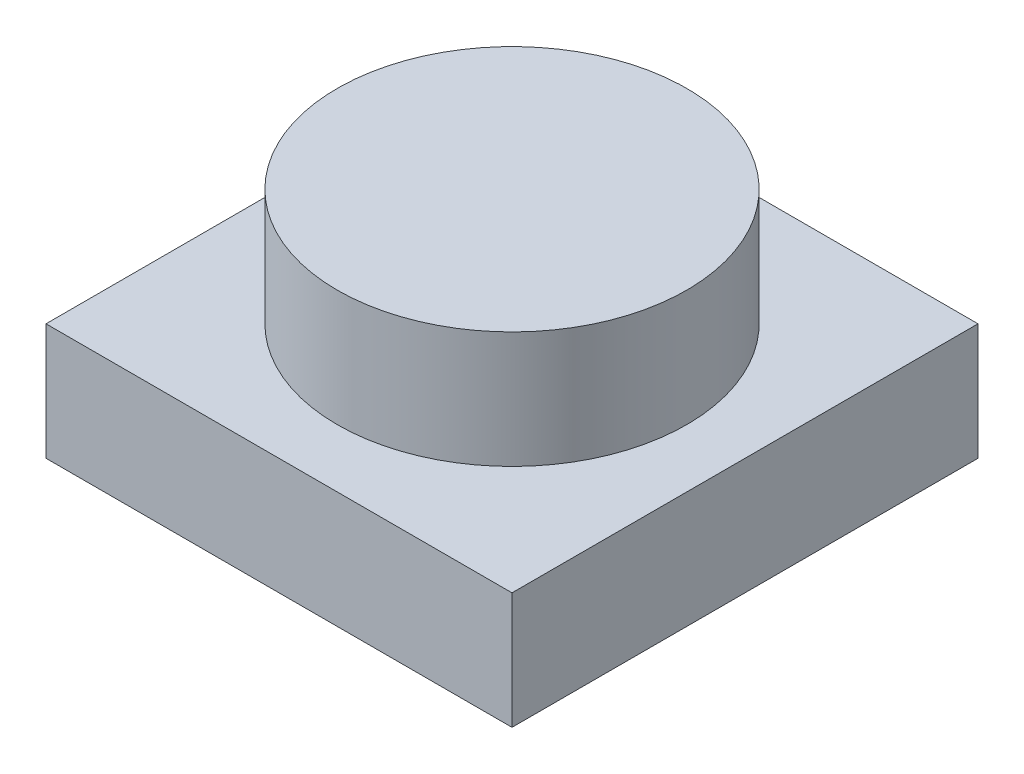
ISO-10303-21;
HEADER;
FILE_DESCRIPTION(('STEP AP214'),'2;1');
FILE_NAME('part.step','',(''),(''),'','','');
FILE_SCHEMA(('AUTOMOTIVE_DESIGN { 1 0 10303 214 1 1 1 1 }'));
ENDSEC;
DATA;
#1=APPLICATION_CONTEXT('core data for automotive mechanical design processes');
#2=APPLICATION_PROTOCOL_DEFINITION('international standard','automotive_design',2000,#1);
#3=PRODUCT_CONTEXT('',#1,'mechanical');
#4=PRODUCT('Part','Part','',(#3));
#5=PRODUCT_RELATED_PRODUCT_CATEGORY('part','',(#4));
#6=PRODUCT_DEFINITION_FORMATION('','',#4);
#7=PRODUCT_DEFINITION_CONTEXT('part definition',#1,'design');
#8=PRODUCT_DEFINITION('design','',#6,#7);
#9=PRODUCT_DEFINITION_SHAPE('','',#8);
#10=(LENGTH_UNIT() NAMED_UNIT(*) SI_UNIT(.MILLI.,.METRE.));
#11=(NAMED_UNIT(*) PLANE_ANGLE_UNIT() SI_UNIT($,.RADIAN.));
#12=(NAMED_UNIT(*) SI_UNIT($,.STERADIAN.) SOLID_ANGLE_UNIT());
#13=UNCERTAINTY_MEASURE_WITH_UNIT(LENGTH_MEASURE(1.E-05),#10,'distance_accuracy_value','');
#14=(GEOMETRIC_REPRESENTATION_CONTEXT(3) GLOBAL_UNCERTAINTY_ASSIGNED_CONTEXT((#13)) GLOBAL_UNIT_ASSIGNED_CONTEXT((#10,
#11,#12)) REPRESENTATION_CONTEXT('',''));
#15=CARTESIAN_POINT('',(0.,0.,0.));
#16=DIRECTION('',(0.,0.,1.));
#17=DIRECTION('',(1.,0.,0.));
#18=AXIS2_PLACEMENT_3D('',#15,#16,#17);
#19=CARTESIAN_POINT('',(-4.,2.,4.));
#20=DIRECTION('',(1.,0.,0.));
#21=DIRECTION('',(0.,0.,-1.));
#22=AXIS2_PLACEMENT_3D('',#19,#20,#21);
#23=PLANE('',#22);
#24=DIRECTION('',(0.,0.,1.));
#25=VECTOR('',#24,1.);
#26=CARTESIAN_POINT('',(-4.,0.,4.));
#27=LINE('',#26,#25);
#28=CARTESIAN_POINT('',(-4.,0.,-4.));
#29=VERTEX_POINT('',#28);
#30=CARTESIAN_POINT('',(-4.,0.,4.));
#31=VERTEX_POINT('',#30);
#32=EDGE_CURVE('E110',#29,#31,#27,.T.);
#33=ORIENTED_EDGE('',*,*,#32,.T.);
#34=DIRECTION('',(0.,-1.,0.));
#35=VECTOR('',#34,1.);
#36=CARTESIAN_POINT('',(-4.,2.,4.));
#37=LINE('',#36,#35);
#38=CARTESIAN_POINT('',(-4.,2.,4.));
#39=VERTEX_POINT('',#38);
#40=EDGE_CURVE('E42',#39,#31,#37,.T.);
#41=ORIENTED_EDGE('',*,*,#40,.F.);
#42=DIRECTION('',(0.,0.,1.));
#43=VECTOR('',#42,1.);
#44=CARTESIAN_POINT('',(-4.,2.,4.));
#45=LINE('',#44,#43);
#46=CARTESIAN_POINT('',(-4.,2.,-4.));
#47=VERTEX_POINT('',#46);
#48=EDGE_CURVE('E93',#47,#39,#45,.T.);
#49=ORIENTED_EDGE('',*,*,#48,.F.);
#50=DIRECTION('',(0.,-1.,0.));
#51=VECTOR('',#50,1.);
#52=CARTESIAN_POINT('',(-4.,2.,-4.));
#53=LINE('',#52,#51);
#54=EDGE_CURVE('E106',#47,#29,#53,.T.);
#55=ORIENTED_EDGE('',*,*,#54,.T.);
#56=EDGE_LOOP('',(#33,#41,#49,#55));
#57=FACE_BOUND('',#56,.T.);
#58=ADVANCED_FACE('F39',(#57),#23,.F.);
#59=CARTESIAN_POINT('',(4.,2.,4.));
#60=DIRECTION('',(0.,0.,-1.));
#61=DIRECTION('',(-1.,0.,0.));
#62=AXIS2_PLACEMENT_3D('',#59,#60,#61);
#63=PLANE('',#62);
#64=DIRECTION('',(1.,0.,0.));
#65=VECTOR('',#64,1.);
#66=CARTESIAN_POINT('',(4.,0.,4.));
#67=LINE('',#66,#65);
#68=CARTESIAN_POINT('',(4.,0.,4.));
#69=VERTEX_POINT('',#68);
#70=EDGE_CURVE('E99',#31,#69,#67,.T.);
#71=ORIENTED_EDGE('',*,*,#70,.T.);
#72=DIRECTION('',(0.,-1.,0.));
#73=VECTOR('',#72,1.);
#74=CARTESIAN_POINT('',(4.,2.,4.));
#75=LINE('',#74,#73);
#76=CARTESIAN_POINT('',(4.,2.,4.));
#77=VERTEX_POINT('',#76);
#78=EDGE_CURVE('E97',#77,#69,#75,.T.);
#79=ORIENTED_EDGE('',*,*,#78,.F.);
#80=DIRECTION('',(1.,0.,0.));
#81=VECTOR('',#80,1.);
#82=CARTESIAN_POINT('',(4.,2.,4.));
#83=LINE('',#82,#81);
#84=EDGE_CURVE('E88',#39,#77,#83,.T.);
#85=ORIENTED_EDGE('',*,*,#84,.F.);
#86=ORIENTED_EDGE('',*,*,#40,.T.);
#87=EDGE_LOOP('',(#71,#79,#85,#86));
#88=FACE_BOUND('',#87,.T.);
#89=ADVANCED_FACE('F98',(#88),#63,.F.);
#90=CARTESIAN_POINT('',(4.,2.,4.));
#91=DIRECTION('',(-1.,0.,0.));
#92=DIRECTION('',(0.,0.,1.));
#93=AXIS2_PLACEMENT_3D('',#90,#91,#92);
#94=PLANE('',#93);
#95=DIRECTION('',(0.,0.,-1.));
#96=VECTOR('',#95,1.);
#97=CARTESIAN_POINT('',(4.,0.,4.));
#98=LINE('',#97,#96);
#99=CARTESIAN_POINT('',(4.,0.,-4.));
#100=VERTEX_POINT('',#99);
#101=EDGE_CURVE('E74',#69,#100,#98,.T.);
#102=ORIENTED_EDGE('',*,*,#101,.T.);
#103=DIRECTION('',(0.,-1.,0.));
#104=VECTOR('',#103,1.);
#105=CARTESIAN_POINT('',(4.,2.,-4.));
#106=LINE('',#105,#104);
#107=CARTESIAN_POINT('',(4.,2.,-4.));
#108=VERTEX_POINT('',#107);
#109=EDGE_CURVE('E101',#108,#100,#106,.T.);
#110=ORIENTED_EDGE('',*,*,#109,.F.);
#111=DIRECTION('',(0.,0.,-1.));
#112=VECTOR('',#111,1.);
#113=CARTESIAN_POINT('',(4.,2.,4.));
#114=LINE('',#113,#112);
#115=EDGE_CURVE('E91',#77,#108,#114,.T.);
#116=ORIENTED_EDGE('',*,*,#115,.F.);
#117=ORIENTED_EDGE('',*,*,#78,.T.);
#118=EDGE_LOOP('',(#102,#110,#116,#117));
#119=FACE_BOUND('',#118,.T.);
#120=ADVANCED_FACE('F102',(#119),#94,.F.);
#121=CARTESIAN_POINT('',(4.,2.,-4.));
#122=DIRECTION('',(0.,0.,1.));
#123=DIRECTION('',(1.,0.,0.));
#124=AXIS2_PLACEMENT_3D('',#121,#122,#123);
#125=PLANE('',#124);
#126=DIRECTION('',(-1.,0.,0.));
#127=VECTOR('',#126,1.);
#128=CARTESIAN_POINT('',(4.,0.,-4.));
#129=LINE('',#128,#127);
#130=EDGE_CURVE('E80',#100,#29,#129,.T.);
#131=ORIENTED_EDGE('',*,*,#130,.T.);
#132=ORIENTED_EDGE('',*,*,#54,.F.);
#133=DIRECTION('',(-1.,0.,0.));
#134=VECTOR('',#133,1.);
#135=CARTESIAN_POINT('',(4.,2.,-4.));
#136=LINE('',#135,#134);
#137=EDGE_CURVE('E57',#108,#47,#136,.T.);
#138=ORIENTED_EDGE('',*,*,#137,.F.);
#139=ORIENTED_EDGE('',*,*,#109,.T.);
#140=EDGE_LOOP('',(#131,#132,#138,#139));
#141=FACE_BOUND('',#140,.T.);
#142=ADVANCED_FACE('F124',(#141),#125,.F.);
#143=CARTESIAN_POINT('',(0.,2.,0.));
#144=DIRECTION('',(0.,1.,0.));
#145=DIRECTION('',(0.,0.,1.));
#146=AXIS2_PLACEMENT_3D('',#143,#144,#145);
#147=PLANE('',#146);
#148=CARTESIAN_POINT('',(0.,2.,0.));
#149=DIRECTION('',(0.,1.,0.));
#150=DIRECTION('',(0.,0.,1.));
#151=AXIS2_PLACEMENT_3D('',#148,#149,#150);
#152=CIRCLE('',#151,3.);
#153=CARTESIAN_POINT('',(0.,2.,3.));
#154=VERTEX_POINT('',#153);
#155=EDGE_CURVE('E11',#154,#154,#152,.T.);
#156=ORIENTED_EDGE('',*,*,#155,.F.);
#157=EDGE_LOOP('',(#156));
#158=FACE_BOUND('',#157,.T.);
#159=ORIENTED_EDGE('',*,*,#48,.T.);
#160=ORIENTED_EDGE('',*,*,#84,.T.);
#161=ORIENTED_EDGE('',*,*,#115,.T.);
#162=ORIENTED_EDGE('',*,*,#137,.T.);
#163=EDGE_LOOP('',(#159,#160,#161,#162));
#164=FACE_BOUND('',#163,.T.);
#165=ADVANCED_FACE('F89',(#158,#164),#147,.T.);
#166=CARTESIAN_POINT('',(0.,0.,0.));
#167=DIRECTION('',(0.,1.,0.));
#168=DIRECTION('',(0.,0.,1.));
#169=AXIS2_PLACEMENT_3D('',#166,#167,#168);
#170=PLANE('',#169);
#171=ORIENTED_EDGE('',*,*,#32,.F.);
#172=ORIENTED_EDGE('',*,*,#130,.F.);
#173=ORIENTED_EDGE('',*,*,#101,.F.);
#174=ORIENTED_EDGE('',*,*,#70,.F.);
#175=EDGE_LOOP('',(#171,#172,#173,#174));
#176=FACE_BOUND('',#175,.T.);
#177=ADVANCED_FACE('F127',(#176),#170,.F.);
#178=CARTESIAN_POINT('',(0.,4.,0.));
#179=DIRECTION('',(0.,-1.,0.));
#180=DIRECTION('',(0.,0.,-1.));
#181=AXIS2_PLACEMENT_3D('',#178,#179,#180);
#182=CYLINDRICAL_SURFACE('',#181,3.);
#183=CARTESIAN_POINT('',(0.,4.,0.));
#184=DIRECTION('',(0.,1.,0.));
#185=DIRECTION('',(0.,0.,1.));
#186=AXIS2_PLACEMENT_3D('',#183,#184,#185);
#187=CIRCLE('',#186,3.);
#188=CARTESIAN_POINT('',(0.,4.,3.));
#189=VERTEX_POINT('',#188);
#190=EDGE_CURVE('E114',#189,#189,#187,.T.);
#191=ORIENTED_EDGE('',*,*,#190,.F.);
#192=EDGE_LOOP('',(#191));
#193=FACE_BOUND('',#192,.T.);
#194=ORIENTED_EDGE('',*,*,#155,.T.);
#195=EDGE_LOOP('',(#194));
#196=FACE_BOUND('',#195,.T.);
#197=ADVANCED_FACE('F137',(#193,#196),#182,.T.);
#198=CARTESIAN_POINT('',(0.,4.,0.));
#199=DIRECTION('',(0.,1.,0.));
#200=DIRECTION('',(0.,0.,1.));
#201=AXIS2_PLACEMENT_3D('',#198,#199,#200);
#202=PLANE('',#201);
#203=ORIENTED_EDGE('',*,*,#190,.T.);
#204=EDGE_LOOP('',(#203));
#205=FACE_BOUND('',#204,.T.);
#206=ADVANCED_FACE('F135',(#205),#202,.T.);
#207=CLOSED_SHELL('',(#58,#89,#120,#142,#165,#177,#197,#206));
#208=MANIFOLD_SOLID_BREP('B2',#207);
#209=ADVANCED_BREP_SHAPE_REPRESENTATION('',(#18,#208),#14);
#210=SHAPE_DEFINITION_REPRESENTATION(#9,#209);
ENDSEC;
END-ISO-10303-21;
